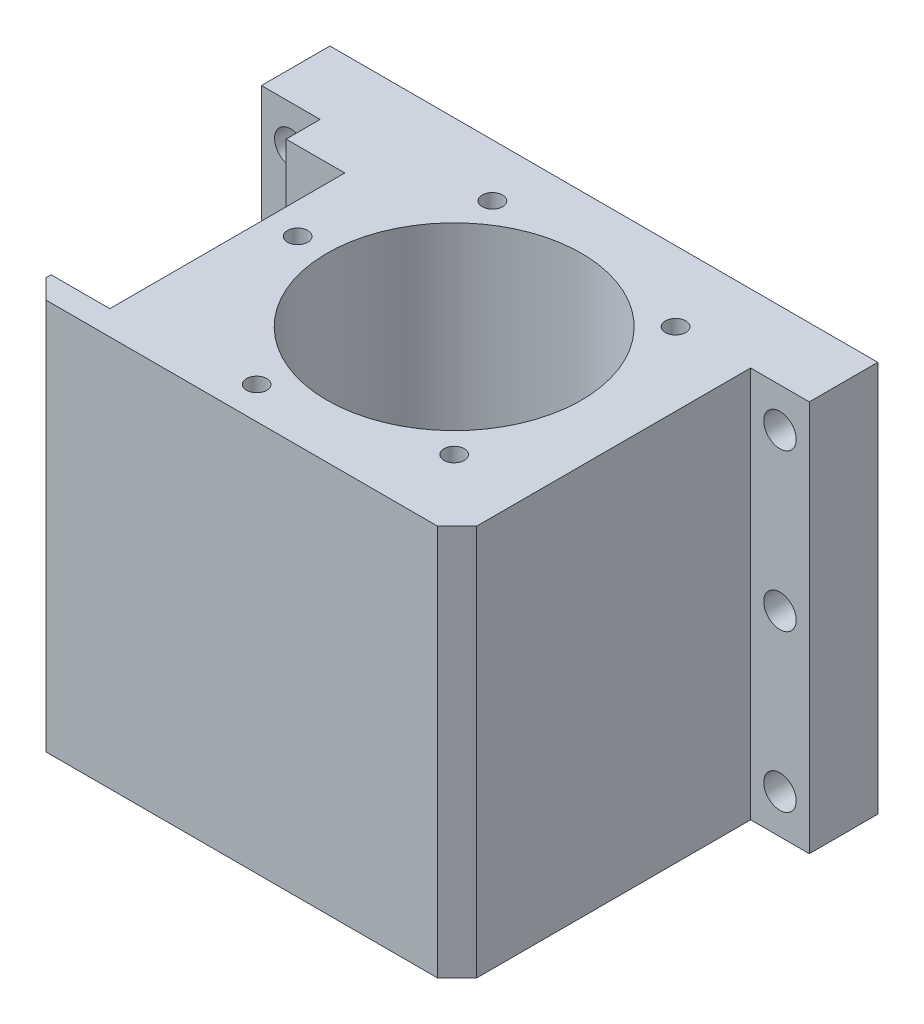
ISO-10303-21;
HEADER;
FILE_DESCRIPTION(('STEP AP214'),'2;1');
FILE_NAME('part.step','',(''),(''),'','','');
FILE_SCHEMA(('AUTOMOTIVE_DESIGN { 1 0 10303 214 1 1 1 1 }'));
ENDSEC;
DATA;
#1=APPLICATION_CONTEXT('core data for automotive mechanical design processes');
#2=APPLICATION_PROTOCOL_DEFINITION('international standard','automotive_design',2000,#1);
#3=PRODUCT_CONTEXT('',#1,'mechanical');
#4=PRODUCT('Part','Part','',(#3));
#5=PRODUCT_RELATED_PRODUCT_CATEGORY('part','',(#4));
#6=PRODUCT_DEFINITION_FORMATION('','',#4);
#7=PRODUCT_DEFINITION_CONTEXT('part definition',#1,'design');
#8=PRODUCT_DEFINITION('design','',#6,#7);
#9=PRODUCT_DEFINITION_SHAPE('','',#8);
#10=(LENGTH_UNIT() NAMED_UNIT(*) SI_UNIT(.MILLI.,.METRE.));
#11=(NAMED_UNIT(*) PLANE_ANGLE_UNIT() SI_UNIT($,.RADIAN.));
#12=(NAMED_UNIT(*) SI_UNIT($,.STERADIAN.) SOLID_ANGLE_UNIT());
#13=UNCERTAINTY_MEASURE_WITH_UNIT(LENGTH_MEASURE(1.E-05),#10,'distance_accuracy_value','');
#14=(GEOMETRIC_REPRESENTATION_CONTEXT(3) GLOBAL_UNCERTAINTY_ASSIGNED_CONTEXT((#13)) GLOBAL_UNIT_ASSIGNED_CONTEXT((#10,
#11,#12)) REPRESENTATION_CONTEXT('',''));
#15=CARTESIAN_POINT('',(0.,0.,0.));
#16=DIRECTION('',(0.,0.,1.));
#17=DIRECTION('',(1.,0.,0.));
#18=AXIS2_PLACEMENT_3D('',#15,#16,#17);
#19=CARTESIAN_POINT('',(15.,0.,17.5));
#20=DIRECTION('',(-1.,0.,0.));
#21=DIRECTION('',(0.,-1.,0.));
#22=AXIS2_PLACEMENT_3D('',#19,#20,#21);
#23=PLANE('',#22);
#24=DIRECTION('',(0.,-1.,0.));
#25=VECTOR('',#24,1.);
#26=CARTESIAN_POINT('',(15.,0.,26.2));
#27=LINE('',#26,#25);
#28=CARTESIAN_POINT('',(15.,0.,26.2));
#29=VERTEX_POINT('',#28);
#30=CARTESIAN_POINT('',(15.,-100.,26.2));
#31=VERTEX_POINT('',#30);
#32=EDGE_CURVE('E147',#29,#31,#27,.T.);
#33=ORIENTED_EDGE('',*,*,#32,.F.);
#34=DIRECTION('',(0.,0.,1.));
#35=VECTOR('',#34,1.);
#36=CARTESIAN_POINT('',(15.,0.,17.5));
#37=LINE('',#36,#35);
#38=CARTESIAN_POINT('',(15.,0.,17.5));
#39=VERTEX_POINT('',#38);
#40=EDGE_CURVE('E187',#39,#29,#37,.T.);
#41=ORIENTED_EDGE('',*,*,#40,.F.);
#42=DIRECTION('',(0.,-1.,0.));
#43=VECTOR('',#42,1.);
#44=CARTESIAN_POINT('',(15.,0.,17.5));
#45=LINE('',#44,#43);
#46=CARTESIAN_POINT('',(15.,-100.,17.5));
#47=VERTEX_POINT('',#46);
#48=EDGE_CURVE('E176',#39,#47,#45,.T.);
#49=ORIENTED_EDGE('',*,*,#48,.T.);
#50=DIRECTION('',(0.,0.,1.));
#51=VECTOR('',#50,1.);
#52=CARTESIAN_POINT('',(15.,-100.,17.5));
#53=LINE('',#52,#51);
#54=EDGE_CURVE('E196',#47,#31,#53,.T.);
#55=ORIENTED_EDGE('',*,*,#54,.T.);
#56=EDGE_LOOP('',(#33,#41,#49,#55));
#57=FACE_BOUND('',#56,.T.);
#58=ADVANCED_FACE('F38',(#57),#23,.T.);
#59=CARTESIAN_POINT('',(0.,0.,92.5));
#60=DIRECTION('',(1.,0.,0.));
#61=DIRECTION('',(0.,1.,0.));
#62=AXIS2_PLACEMENT_3D('',#59,#60,#61);
#63=PLANE('',#62);
#64=DIRECTION('',(0.,-1.,0.));
#65=VECTOR('',#64,1.);
#66=CARTESIAN_POINT('',(0.,0.,17.5));
#67=LINE('',#66,#65);
#68=CARTESIAN_POINT('',(0.,0.,17.5));
#69=VERTEX_POINT('',#68);
#70=CARTESIAN_POINT('',(0.,-100.,17.5));
#71=VERTEX_POINT('',#70);
#72=EDGE_CURVE('E199',#69,#71,#67,.T.);
#73=ORIENTED_EDGE('',*,*,#72,.F.);
#74=DIRECTION('',(0.,0.,-1.));
#75=VECTOR('',#74,1.);
#76=CARTESIAN_POINT('',(0.,0.,92.5));
#77=LINE('',#76,#75);
#78=CARTESIAN_POINT('',(0.,0.,0.));
#79=VERTEX_POINT('',#78);
#80=EDGE_CURVE('E221',#69,#79,#77,.T.);
#81=ORIENTED_EDGE('',*,*,#80,.T.);
#82=DIRECTION('',(0.,-1.,0.));
#83=VECTOR('',#82,1.);
#84=CARTESIAN_POINT('',(0.,0.,0.));
#85=LINE('',#84,#83);
#86=CARTESIAN_POINT('',(0.,-100.,0.));
#87=VERTEX_POINT('',#86);
#88=EDGE_CURVE('E210',#79,#87,#85,.T.);
#89=ORIENTED_EDGE('',*,*,#88,.T.);
#90=DIRECTION('',(0.,0.,-1.));
#91=VECTOR('',#90,1.);
#92=CARTESIAN_POINT('',(0.,-100.,92.5));
#93=LINE('',#92,#91);
#94=EDGE_CURVE('E237',#71,#87,#93,.T.);
#95=ORIENTED_EDGE('',*,*,#94,.F.);
#96=EDGE_LOOP('',(#73,#81,#89,#95));
#97=FACE_BOUND('',#96,.T.);
#98=ADVANCED_FACE('F282',(#97),#63,.F.);
#99=CARTESIAN_POINT('',(0.,-100.,92.5));
#100=DIRECTION('',(0.,1.,0.));
#101=DIRECTION('',(0.,0.,1.));
#102=AXIS2_PLACEMENT_3D('',#99,#100,#101);
#103=PLANE('',#102);
#104=CARTESIAN_POINT('',(78.,-100.,85.75));
#105=DIRECTION('',(0.,-1.,0.));
#106=DIRECTION('',(0.,0.,-1.));
#107=AXIS2_PLACEMENT_3D('',#104,#105,#106);
#108=CIRCLE('',#107,2.6);
#109=CARTESIAN_POINT('',(78.,-100.,83.15));
#110=VERTEX_POINT('',#109);
#111=EDGE_CURVE('E356',#110,#110,#108,.T.);
#112=ORIENTED_EDGE('',*,*,#111,.F.);
#113=EDGE_LOOP('',(#112));
#114=FACE_BOUND('',#113,.T.);
#115=CARTESIAN_POINT('',(43.7919965505154,-100.,65.9999999999994));
#116=DIRECTION('',(0.,-1.,0.));
#117=DIRECTION('',(0.,0.,-1.));
#118=AXIS2_PLACEMENT_3D('',#115,#116,#117);
#119=CIRCLE('',#118,2.6);
#120=CARTESIAN_POINT('',(43.7919965505154,-100.,63.3999999999994));
#121=VERTEX_POINT('',#120);
#122=EDGE_CURVE('E360',#121,#121,#119,.T.);
#123=ORIENTED_EDGE('',*,*,#122,.F.);
#124=EDGE_LOOP('',(#123));
#125=FACE_BOUND('',#124,.T.);
#126=CARTESIAN_POINT('',(43.7919965505162,-100.,26.4999999999993));
#127=DIRECTION('',(0.,-1.,0.));
#128=DIRECTION('',(0.,0.,-1.));
#129=AXIS2_PLACEMENT_3D('',#126,#127,#128);
#130=CIRCLE('',#129,2.60000000000001);
#131=CARTESIAN_POINT('',(43.7919965505162,-100.,23.8999999999993));
#132=VERTEX_POINT('',#131);
#133=EDGE_CURVE('E364',#132,#132,#130,.T.);
#134=ORIENTED_EDGE('',*,*,#133,.F.);
#135=EDGE_LOOP('',(#134));
#136=FACE_BOUND('',#135,.T.);
#137=CARTESIAN_POINT('',(78.0000000000019,-100.,6.74999999999999));
#138=DIRECTION('',(0.,-1.,0.));
#139=DIRECTION('',(0.,0.,-1.));
#140=AXIS2_PLACEMENT_3D('',#137,#138,#139);
#141=CIRCLE('',#140,2.60000000000001);
#142=CARTESIAN_POINT('',(78.0000000000019,-100.,4.14999999999998));
#143=VERTEX_POINT('',#142);
#144=EDGE_CURVE('E368',#143,#143,#141,.T.);
#145=ORIENTED_EDGE('',*,*,#144,.F.);
#146=EDGE_LOOP('',(#145));
#147=FACE_BOUND('',#146,.T.);
#148=CARTESIAN_POINT('',(112.208003449487,-100.,26.5000000000008));
#149=DIRECTION('',(0.,-1.,0.));
#150=DIRECTION('',(0.,0.,-1.));
#151=AXIS2_PLACEMENT_3D('',#148,#149,#150);
#152=CIRCLE('',#151,2.59999999999999);
#153=CARTESIAN_POINT('',(112.208003449487,-100.,23.9000000000008));
#154=VERTEX_POINT('',#153);
#155=EDGE_CURVE('E372',#154,#154,#152,.T.);
#156=ORIENTED_EDGE('',*,*,#155,.F.);
#157=EDGE_LOOP('',(#156));
#158=FACE_BOUND('',#157,.T.);
#159=CARTESIAN_POINT('',(112.208003449486,-100.,66.0000000000009));
#160=DIRECTION('',(0.,-1.,0.));
#161=DIRECTION('',(0.,0.,-1.));
#162=AXIS2_PLACEMENT_3D('',#159,#160,#161);
#163=CIRCLE('',#162,2.6);
#164=CARTESIAN_POINT('',(112.208003449486,-100.,63.4000000000009));
#165=VERTEX_POINT('',#164);
#166=EDGE_CURVE('E376',#165,#165,#163,.T.);
#167=ORIENTED_EDGE('',*,*,#166,.F.);
#168=EDGE_LOOP('',(#167));
#169=FACE_BOUND('',#168,.T.);
#170=CARTESIAN_POINT('',(78.,-100.,46.25));
#171=DIRECTION('',(0.,1.,0.));
#172=DIRECTION('',(0.,0.,1.));
#173=AXIS2_PLACEMENT_3D('',#170,#171,#172);
#174=CIRCLE('',#173,32.525);
#175=CARTESIAN_POINT('',(78.,-100.,78.775));
#176=VERTEX_POINT('',#175);
#177=EDGE_CURVE('E207',#176,#176,#174,.T.);
#178=ORIENTED_EDGE('',*,*,#177,.T.);
#179=EDGE_LOOP('',(#178));
#180=FACE_BOUND('',#179,.T.);
#181=DIRECTION('',(0.,0.,1.));
#182=VECTOR('',#181,1.);
#183=CARTESIAN_POINT('',(125.,-100.,17.5));
#184=LINE('',#183,#182);
#185=CARTESIAN_POINT('',(125.,-100.,17.5));
#186=VERTEX_POINT('',#185);
#187=CARTESIAN_POINT('',(125.,-100.,87.5));
#188=VERTEX_POINT('',#187);
#189=EDGE_CURVE('E194',#186,#188,#184,.T.);
#190=ORIENTED_EDGE('',*,*,#189,.T.);
#191=DIRECTION('',(0.707106781186548,0.,-0.707106781186548));
#192=VECTOR('',#191,1.);
#193=CARTESIAN_POINT('',(120.,-100.,92.5));
#194=LINE('',#193,#192);
#195=CARTESIAN_POINT('',(120.,-100.,92.5));
#196=VERTEX_POINT('',#195);
#197=EDGE_CURVE('E47',#188,#196,#194,.F.);
#198=ORIENTED_EDGE('',*,*,#197,.T.);
#199=DIRECTION('',(1.,0.,0.));
#200=VECTOR('',#199,1.);
#201=CARTESIAN_POINT('',(0.,-100.,92.5));
#202=LINE('',#201,#200);
#203=CARTESIAN_POINT('',(20.,-100.,92.5));
#204=VERTEX_POINT('',#203);
#205=EDGE_CURVE('E214',#204,#196,#202,.T.);
#206=ORIENTED_EDGE('',*,*,#205,.F.);
#207=DIRECTION('',(0.707106781186546,0.,0.707106781186549));
#208=VECTOR('',#207,1.);
#209=CARTESIAN_POINT('',(20.,-100.,92.5));
#210=LINE('',#209,#208);
#211=CARTESIAN_POINT('',(15.,-100.,87.5));
#212=VERTEX_POINT('',#211);
#213=EDGE_CURVE('E54',#204,#212,#210,.F.);
#214=ORIENTED_EDGE('',*,*,#213,.T.);
#215=CARTESIAN_POINT('',(15.,-100.,86.25));
#216=VERTEX_POINT('',#215);
#217=EDGE_CURVE('E186',#216,#212,#53,.T.);
#218=ORIENTED_EDGE('',*,*,#217,.F.);
#219=DIRECTION('',(-1.,0.,0.));
#220=VECTOR('',#219,1.);
#221=CARTESIAN_POINT('',(30.,-100.,86.25));
#222=LINE('',#221,#220);
#223=CARTESIAN_POINT('',(30.,-100.,86.25));
#224=VERTEX_POINT('',#223);
#225=EDGE_CURVE('E151',#224,#216,#222,.T.);
#226=ORIENTED_EDGE('',*,*,#225,.F.);
#227=DIRECTION('',(0.,0.,1.));
#228=VECTOR('',#227,1.);
#229=CARTESIAN_POINT('',(30.,-100.,26.2));
#230=LINE('',#229,#228);
#231=CARTESIAN_POINT('',(30.,-100.,26.2));
#232=VERTEX_POINT('',#231);
#233=EDGE_CURVE('E158',#232,#224,#230,.T.);
#234=ORIENTED_EDGE('',*,*,#233,.F.);
#235=DIRECTION('',(-1.,0.,0.));
#236=VECTOR('',#235,1.);
#237=CARTESIAN_POINT('',(30.,-100.,26.2));
#238=LINE('',#237,#236);
#239=EDGE_CURVE('E141',#232,#31,#238,.T.);
#240=ORIENTED_EDGE('',*,*,#239,.T.);
#241=ORIENTED_EDGE('',*,*,#54,.F.);
#242=DIRECTION('',(1.,0.,0.));
#243=VECTOR('',#242,1.);
#244=CARTESIAN_POINT('',(0.,-100.,17.5));
#245=LINE('',#244,#243);
#246=EDGE_CURVE('E202',#71,#47,#245,.T.);
#247=ORIENTED_EDGE('',*,*,#246,.F.);
#248=ORIENTED_EDGE('',*,*,#94,.T.);
#249=DIRECTION('',(1.,0.,0.));
#250=VECTOR('',#249,1.);
#251=CARTESIAN_POINT('',(0.,-100.,0.));
#252=LINE('',#251,#250);
#253=CARTESIAN_POINT('',(140.,-100.,0.));
#254=VERTEX_POINT('',#253);
#255=EDGE_CURVE('E224',#87,#254,#252,.T.);
#256=ORIENTED_EDGE('',*,*,#255,.T.);
#257=DIRECTION('',(0.,0.,-1.));
#258=VECTOR('',#257,1.);
#259=CARTESIAN_POINT('',(140.,-100.,92.5));
#260=LINE('',#259,#258);
#261=CARTESIAN_POINT('',(140.,-100.,17.5));
#262=VERTEX_POINT('',#261);
#263=EDGE_CURVE('E235',#262,#254,#260,.T.);
#264=ORIENTED_EDGE('',*,*,#263,.F.);
#265=EDGE_CURVE('E204',#186,#262,#245,.T.);
#266=ORIENTED_EDGE('',*,*,#265,.F.);
#267=EDGE_LOOP('',(#190,#198,#206,#214,#218,#226,#234,#240,#241,#247,#248,#256,#264,#266));
#268=FACE_BOUND('',#267,.T.);
#269=ADVANCED_FACE('F164',(#114,#125,#136,#147,#158,#169,#180,#268),#103,.F.);
#270=CARTESIAN_POINT('',(140.,0.,92.5));
#271=DIRECTION('',(-1.,0.,0.));
#272=DIRECTION('',(0.,0.,1.));
#273=AXIS2_PLACEMENT_3D('',#270,#271,#272);
#274=PLANE('',#273);
#275=DIRECTION('',(0.,1.,0.));
#276=VECTOR('',#275,1.);
#277=CARTESIAN_POINT('',(140.,0.,17.5));
#278=LINE('',#277,#276);
#279=CARTESIAN_POINT('',(140.,0.,17.5));
#280=VERTEX_POINT('',#279);
#281=EDGE_CURVE('E205',#262,#280,#278,.T.);
#282=ORIENTED_EDGE('',*,*,#281,.F.);
#283=ORIENTED_EDGE('',*,*,#263,.T.);
#284=DIRECTION('',(0.,1.,0.));
#285=VECTOR('',#284,1.);
#286=CARTESIAN_POINT('',(140.,0.,0.));
#287=LINE('',#286,#285);
#288=CARTESIAN_POINT('',(140.,0.,0.));
#289=VERTEX_POINT('',#288);
#290=EDGE_CURVE('E227',#254,#289,#287,.T.);
#291=ORIENTED_EDGE('',*,*,#290,.T.);
#292=DIRECTION('',(0.,0.,-1.));
#293=VECTOR('',#292,1.);
#294=CARTESIAN_POINT('',(140.,0.,92.5));
#295=LINE('',#294,#293);
#296=EDGE_CURVE('E233',#280,#289,#295,.T.);
#297=ORIENTED_EDGE('',*,*,#296,.F.);
#298=EDGE_LOOP('',(#282,#283,#291,#297));
#299=FACE_BOUND('',#298,.T.);
#300=ADVANCED_FACE('F270',(#299),#274,.F.);
#301=CARTESIAN_POINT('',(0.,0.,92.5));
#302=DIRECTION('',(0.,-1.,0.));
#303=DIRECTION('',(0.,0.,-1.));
#304=AXIS2_PLACEMENT_3D('',#301,#302,#303);
#305=PLANE('',#304);
#306=CARTESIAN_POINT('',(38.,0.,46.25));
#307=DIRECTION('',(0.,1.,0.));
#308=DIRECTION('',(0.,0.,1.));
#309=AXIS2_PLACEMENT_3D('',#306,#307,#308);
#310=CIRCLE('',#309,2.6);
#311=CARTESIAN_POINT('',(38.,0.,48.85));
#312=VERTEX_POINT('',#311);
#313=EDGE_CURVE('E468',#312,#312,#310,.T.);
#314=ORIENTED_EDGE('',*,*,#313,.F.);
#315=EDGE_LOOP('',(#314));
#316=FACE_BOUND('',#315,.T.);
#317=CARTESIAN_POINT('',(55.0258080031213,0.,13.5057409292781));
#318=DIRECTION('',(0.,1.,0.));
#319=DIRECTION('',(0.,0.,1.));
#320=AXIS2_PLACEMENT_3D('',#317,#318,#319);
#321=CIRCLE('',#320,2.6);
#322=CARTESIAN_POINT('',(55.0258080031213,0.,16.1057409292781));
#323=VERTEX_POINT('',#322);
#324=EDGE_CURVE('E462',#323,#323,#321,.T.);
#325=ORIENTED_EDGE('',*,*,#324,.F.);
#326=EDGE_LOOP('',(#325));
#327=FACE_BOUND('',#326,.T.);
#328=CARTESIAN_POINT('',(65.5344903631068,0.,84.25803953761));
#329=DIRECTION('',(0.,1.,0.));
#330=DIRECTION('',(0.,0.,1.));
#331=AXIS2_PLACEMENT_3D('',#328,#329,#330);
#332=CIRCLE('',#331,2.6);
#333=CARTESIAN_POINT('',(65.5344903631068,0.,86.85803953761));
#334=VERTEX_POINT('',#333);
#335=EDGE_CURVE('E456',#334,#334,#332,.T.);
#336=ORIENTED_EDGE('',*,*,#335,.F.);
#337=EDGE_LOOP('',(#336));
#338=FACE_BOUND('',#337,.T.);
#339=CARTESIAN_POINT('',(106.284271247462,0.,17.9657287525373));
#340=DIRECTION('',(0.,1.,0.));
#341=DIRECTION('',(0.,0.,1.));
#342=AXIS2_PLACEMENT_3D('',#339,#340,#341);
#343=CIRCLE('',#342,2.59999999999999);
#344=CARTESIAN_POINT('',(106.284271247462,0.,20.5657287525373));
#345=VERTEX_POINT('',#344);
#346=EDGE_CURVE('E450',#345,#345,#343,.T.);
#347=ORIENTED_EDGE('',*,*,#346,.F.);
#348=EDGE_LOOP('',(#347));
#349=FACE_BOUND('',#348,.T.);
#350=CARTESIAN_POINT('',(106.284271247463,0.,74.5342712474612));
#351=DIRECTION('',(0.,1.,0.));
#352=DIRECTION('',(0.,0.,1.));
#353=AXIS2_PLACEMENT_3D('',#350,#351,#352);
#354=CIRCLE('',#353,2.6);
#355=CARTESIAN_POINT('',(106.284271247463,0.,77.1342712474612));
#356=VERTEX_POINT('',#355);
#357=EDGE_CURVE('E444',#356,#356,#354,.T.);
#358=ORIENTED_EDGE('',*,*,#357,.F.);
#359=EDGE_LOOP('',(#358));
#360=FACE_BOUND('',#359,.T.);
#361=DIRECTION('',(-1.,0.,0.));
#362=VECTOR('',#361,1.);
#363=CARTESIAN_POINT('',(0.,0.,92.5));
#364=LINE('',#363,#362);
#365=CARTESIAN_POINT('',(120.,0.,92.5));
#366=VERTEX_POINT('',#365);
#367=CARTESIAN_POINT('',(20.,0.,92.5));
#368=VERTEX_POINT('',#367);
#369=EDGE_CURVE('E217',#366,#368,#364,.T.);
#370=ORIENTED_EDGE('',*,*,#369,.F.);
#371=DIRECTION('',(-0.707106781186548,0.,0.707106781186548));
#372=VECTOR('',#371,1.);
#373=CARTESIAN_POINT('',(120.,0.,92.5));
#374=LINE('',#373,#372);
#375=CARTESIAN_POINT('',(125.,0.,87.5));
#376=VERTEX_POINT('',#375);
#377=EDGE_CURVE('E247',#366,#376,#374,.F.);
#378=ORIENTED_EDGE('',*,*,#377,.T.);
#379=DIRECTION('',(0.,0.,1.));
#380=VECTOR('',#379,1.);
#381=CARTESIAN_POINT('',(125.,0.,17.5));
#382=LINE('',#381,#380);
#383=CARTESIAN_POINT('',(125.,0.,17.5));
#384=VERTEX_POINT('',#383);
#385=EDGE_CURVE('E192',#384,#376,#382,.T.);
#386=ORIENTED_EDGE('',*,*,#385,.F.);
#387=DIRECTION('',(-1.,0.,0.));
#388=VECTOR('',#387,1.);
#389=CARTESIAN_POINT('',(0.,0.,17.5));
#390=LINE('',#389,#388);
#391=EDGE_CURVE('E200',#280,#384,#390,.T.);
#392=ORIENTED_EDGE('',*,*,#391,.F.);
#393=ORIENTED_EDGE('',*,*,#296,.T.);
#394=DIRECTION('',(-1.,0.,0.));
#395=VECTOR('',#394,1.);
#396=CARTESIAN_POINT('',(0.,0.,0.));
#397=LINE('',#396,#395);
#398=EDGE_CURVE('E218',#289,#79,#397,.T.);
#399=ORIENTED_EDGE('',*,*,#398,.T.);
#400=ORIENTED_EDGE('',*,*,#80,.F.);
#401=EDGE_CURVE('E190',#39,#69,#390,.T.);
#402=ORIENTED_EDGE('',*,*,#401,.F.);
#403=ORIENTED_EDGE('',*,*,#40,.T.);
#404=DIRECTION('',(-1.,0.,0.));
#405=VECTOR('',#404,1.);
#406=CARTESIAN_POINT('',(30.,0.,26.2));
#407=LINE('',#406,#405);
#408=CARTESIAN_POINT('',(30.,0.,26.2));
#409=VERTEX_POINT('',#408);
#410=EDGE_CURVE('E174',#409,#29,#407,.T.);
#411=ORIENTED_EDGE('',*,*,#410,.F.);
#412=DIRECTION('',(0.,0.,-1.));
#413=VECTOR('',#412,1.);
#414=CARTESIAN_POINT('',(30.,0.,26.2));
#415=LINE('',#414,#413);
#416=CARTESIAN_POINT('',(30.,0.,86.25));
#417=VERTEX_POINT('',#416);
#418=EDGE_CURVE('E152',#417,#409,#415,.T.);
#419=ORIENTED_EDGE('',*,*,#418,.F.);
#420=DIRECTION('',(-1.,0.,0.));
#421=VECTOR('',#420,1.);
#422=CARTESIAN_POINT('',(30.,0.,86.25));
#423=LINE('',#422,#421);
#424=CARTESIAN_POINT('',(15.,0.,86.25));
#425=VERTEX_POINT('',#424);
#426=EDGE_CURVE('E177',#417,#425,#423,.T.);
#427=ORIENTED_EDGE('',*,*,#426,.T.);
#428=CARTESIAN_POINT('',(15.,0.,87.5));
#429=VERTEX_POINT('',#428);
#430=EDGE_CURVE('E191',#425,#429,#37,.T.);
#431=ORIENTED_EDGE('',*,*,#430,.T.);
#432=DIRECTION('',(-0.707106781186546,0.,-0.707106781186549));
#433=VECTOR('',#432,1.);
#434=CARTESIAN_POINT('',(20.,0.,92.5));
#435=LINE('',#434,#433);
#436=EDGE_CURVE('E245',#429,#368,#435,.F.);
#437=ORIENTED_EDGE('',*,*,#436,.T.);
#438=EDGE_LOOP('',(#370,#378,#386,#392,#393,#399,#400,#402,#403,#411,#419,#427,#431,#437));
#439=FACE_BOUND('',#438,.T.);
#440=CARTESIAN_POINT('',(78.,0.,46.25));
#441=DIRECTION('',(0.,1.,0.));
#442=DIRECTION('',(0.,0.,1.));
#443=AXIS2_PLACEMENT_3D('',#440,#441,#442);
#444=CIRCLE('',#443,32.525);
#445=CARTESIAN_POINT('',(78.,0.,78.775));
#446=VERTEX_POINT('',#445);
#447=EDGE_CURVE('E211',#446,#446,#444,.T.);
#448=ORIENTED_EDGE('',*,*,#447,.F.);
#449=EDGE_LOOP('',(#448));
#450=FACE_BOUND('',#449,.T.);
#451=ADVANCED_FACE('F261',(#316,#327,#338,#349,#360,#439,#450),#305,.F.);
#452=CARTESIAN_POINT('',(0.,0.,92.5));
#453=DIRECTION('',(0.,0.,1.));
#454=DIRECTION('',(1.,0.,0.));
#455=AXIS2_PLACEMENT_3D('',#452,#453,#454);
#456=PLANE('',#455);
#457=ORIENTED_EDGE('',*,*,#205,.T.);
#458=DIRECTION('',(0.,1.,0.));
#459=VECTOR('',#458,1.);
#460=CARTESIAN_POINT('',(120.,0.,92.5));
#461=LINE('',#460,#459);
#462=EDGE_CURVE('E242',#196,#366,#461,.T.);
#463=ORIENTED_EDGE('',*,*,#462,.T.);
#464=ORIENTED_EDGE('',*,*,#369,.T.);
#465=DIRECTION('',(0.,-1.,0.));
#466=VECTOR('',#465,1.);
#467=CARTESIAN_POINT('',(20.,0.,92.5));
#468=LINE('',#467,#466);
#469=EDGE_CURVE('E239',#368,#204,#468,.T.);
#470=ORIENTED_EDGE('',*,*,#469,.T.);
#471=EDGE_LOOP('',(#457,#463,#464,#470));
#472=FACE_BOUND('',#471,.T.);
#473=ADVANCED_FACE('F255',(#472),#456,.T.);
#474=CARTESIAN_POINT('',(0.,0.,0.));
#475=DIRECTION('',(0.,0.,1.));
#476=DIRECTION('',(1.,0.,0.));
#477=AXIS2_PLACEMENT_3D('',#474,#475,#476);
#478=PLANE('',#477);
#479=CARTESIAN_POINT('',(7.50000000000042,-50.,0.));
#480=DIRECTION('',(0.,0.,1.));
#481=DIRECTION('',(1.,0.,0.));
#482=AXIS2_PLACEMENT_3D('',#479,#480,#481);
#483=CIRCLE('',#482,4.15);
#484=CARTESIAN_POINT('',(11.6500000000004,-50.,0.));
#485=VERTEX_POINT('',#484);
#486=EDGE_CURVE('E429',#485,#485,#483,.T.);
#487=ORIENTED_EDGE('',*,*,#486,.T.);
#488=EDGE_LOOP('',(#487));
#489=FACE_BOUND('',#488,.T.);
#490=CARTESIAN_POINT('',(132.500000000001,-90.,0.));
#491=DIRECTION('',(0.,0.,1.));
#492=DIRECTION('',(1.,0.,0.));
#493=AXIS2_PLACEMENT_3D('',#490,#491,#492);
#494=CIRCLE('',#493,4.14999999999998);
#495=CARTESIAN_POINT('',(136.650000000001,-90.,0.));
#496=VERTEX_POINT('',#495);
#497=EDGE_CURVE('E418',#496,#496,#494,.T.);
#498=ORIENTED_EDGE('',*,*,#497,.T.);
#499=EDGE_LOOP('',(#498));
#500=FACE_BOUND('',#499,.T.);
#501=CARTESIAN_POINT('',(132.5,-50.,0.));
#502=DIRECTION('',(0.,0.,1.));
#503=DIRECTION('',(1.,0.,0.));
#504=AXIS2_PLACEMENT_3D('',#501,#502,#503);
#505=CIRCLE('',#504,4.14999999999998);
#506=CARTESIAN_POINT('',(136.65,-50.,0.));
#507=VERTEX_POINT('',#506);
#508=EDGE_CURVE('E417',#507,#507,#505,.T.);
#509=ORIENTED_EDGE('',*,*,#508,.T.);
#510=EDGE_LOOP('',(#509));
#511=FACE_BOUND('',#510,.T.);
#512=CARTESIAN_POINT('',(132.5,-10.,0.));
#513=DIRECTION('',(0.,0.,1.));
#514=DIRECTION('',(1.,0.,0.));
#515=AXIS2_PLACEMENT_3D('',#512,#513,#514);
#516=CIRCLE('',#515,4.14999999999998);
#517=CARTESIAN_POINT('',(136.65,-10.,0.));
#518=VERTEX_POINT('',#517);
#519=EDGE_CURVE('E411',#518,#518,#516,.T.);
#520=ORIENTED_EDGE('',*,*,#519,.T.);
#521=EDGE_LOOP('',(#520));
#522=FACE_BOUND('',#521,.T.);
#523=CARTESIAN_POINT('',(7.50000000000083,-90.,0.));
#524=DIRECTION('',(0.,0.,1.));
#525=DIRECTION('',(1.,0.,0.));
#526=AXIS2_PLACEMENT_3D('',#523,#524,#525);
#527=CIRCLE('',#526,4.15);
#528=CARTESIAN_POINT('',(11.6500000000008,-90.,0.));
#529=VERTEX_POINT('',#528);
#530=EDGE_CURVE('E430',#529,#529,#527,.T.);
#531=ORIENTED_EDGE('',*,*,#530,.T.);
#532=EDGE_LOOP('',(#531));
#533=FACE_BOUND('',#532,.T.);
#534=CARTESIAN_POINT('',(7.5,-10.,0.));
#535=DIRECTION('',(0.,0.,1.));
#536=DIRECTION('',(1.,0.,0.));
#537=AXIS2_PLACEMENT_3D('',#534,#535,#536);
#538=CIRCLE('',#537,4.15);
#539=CARTESIAN_POINT('',(11.65,-10.,0.));
#540=VERTEX_POINT('',#539);
#541=EDGE_CURVE('E403',#540,#540,#538,.T.);
#542=ORIENTED_EDGE('',*,*,#541,.T.);
#543=EDGE_LOOP('',(#542));
#544=FACE_BOUND('',#543,.T.);
#545=ORIENTED_EDGE('',*,*,#88,.F.);
#546=ORIENTED_EDGE('',*,*,#398,.F.);
#547=ORIENTED_EDGE('',*,*,#290,.F.);
#548=ORIENTED_EDGE('',*,*,#255,.F.);
#549=EDGE_LOOP('',(#545,#546,#547,#548));
#550=FACE_BOUND('',#549,.T.);
#551=ADVANCED_FACE('F277',(#489,#500,#511,#522,#533,#544,#550),#478,.F.);
#552=CARTESIAN_POINT('',(78.,-100.,46.25));
#553=DIRECTION('',(0.,1.,0.));
#554=DIRECTION('',(0.,0.,1.));
#555=AXIS2_PLACEMENT_3D('',#552,#553,#554);
#556=CYLINDRICAL_SURFACE('',#555,32.525);
#557=ORIENTED_EDGE('',*,*,#177,.F.);
#558=EDGE_LOOP('',(#557));
#559=FACE_BOUND('',#558,.T.);
#560=ORIENTED_EDGE('',*,*,#447,.T.);
#561=EDGE_LOOP('',(#560));
#562=FACE_BOUND('',#561,.T.);
#563=ADVANCED_FACE('F330',(#559,#562),#556,.F.);
#564=CARTESIAN_POINT('',(125.,0.,17.5));
#565=DIRECTION('',(1.,0.,0.));
#566=DIRECTION('',(0.,1.,0.));
#567=AXIS2_PLACEMENT_3D('',#564,#565,#566);
#568=PLANE('',#567);
#569=ORIENTED_EDGE('',*,*,#385,.T.);
#570=DIRECTION('',(0.,-1.,0.));
#571=VECTOR('',#570,1.);
#572=CARTESIAN_POINT('',(125.,0.,87.5));
#573=LINE('',#572,#571);
#574=EDGE_CURVE('E62',#376,#188,#573,.T.);
#575=ORIENTED_EDGE('',*,*,#574,.T.);
#576=ORIENTED_EDGE('',*,*,#189,.F.);
#577=DIRECTION('',(0.,1.,0.));
#578=VECTOR('',#577,1.);
#579=CARTESIAN_POINT('',(125.,0.,17.5));
#580=LINE('',#579,#578);
#581=EDGE_CURVE('E183',#186,#384,#580,.T.);
#582=ORIENTED_EDGE('',*,*,#581,.T.);
#583=EDGE_LOOP('',(#569,#575,#576,#582));
#584=FACE_BOUND('',#583,.T.);
#585=ADVANCED_FACE('F264',(#584),#568,.T.);
#586=CARTESIAN_POINT('',(70.,-50.,17.5));
#587=DIRECTION('',(0.,0.,1.));
#588=DIRECTION('',(1.,0.,0.));
#589=AXIS2_PLACEMENT_3D('',#586,#587,#588);
#590=PLANE('',#589);
#591=CARTESIAN_POINT('',(132.500000000001,-90.,17.5));
#592=DIRECTION('',(0.,0.,1.));
#593=DIRECTION('',(1.,0.,0.));
#594=AXIS2_PLACEMENT_3D('',#591,#592,#593);
#595=CIRCLE('',#594,4.14999999999998);
#596=CARTESIAN_POINT('',(136.650000000001,-90.,17.5));
#597=VERTEX_POINT('',#596);
#598=EDGE_CURVE('E433',#597,#597,#595,.T.);
#599=ORIENTED_EDGE('',*,*,#598,.F.);
#600=EDGE_LOOP('',(#599));
#601=FACE_BOUND('',#600,.T.);
#602=CARTESIAN_POINT('',(132.5,-50.,17.5));
#603=DIRECTION('',(0.,0.,1.));
#604=DIRECTION('',(1.,0.,0.));
#605=AXIS2_PLACEMENT_3D('',#602,#603,#604);
#606=CIRCLE('',#605,4.14999999999998);
#607=CARTESIAN_POINT('',(136.65,-50.,17.5));
#608=VERTEX_POINT('',#607);
#609=EDGE_CURVE('E414',#608,#608,#606,.T.);
#610=ORIENTED_EDGE('',*,*,#609,.F.);
#611=EDGE_LOOP('',(#610));
#612=FACE_BOUND('',#611,.T.);
#613=CARTESIAN_POINT('',(132.5,-10.,17.5));
#614=DIRECTION('',(0.,0.,1.));
#615=DIRECTION('',(1.,0.,0.));
#616=AXIS2_PLACEMENT_3D('',#613,#614,#615);
#617=CIRCLE('',#616,4.14999999999998);
#618=CARTESIAN_POINT('',(136.65,-10.,17.5));
#619=VERTEX_POINT('',#618);
#620=EDGE_CURVE('E421',#619,#619,#617,.T.);
#621=ORIENTED_EDGE('',*,*,#620,.F.);
#622=EDGE_LOOP('',(#621));
#623=FACE_BOUND('',#622,.T.);
#624=ORIENTED_EDGE('',*,*,#265,.T.);
#625=ORIENTED_EDGE('',*,*,#281,.T.);
#626=ORIENTED_EDGE('',*,*,#391,.T.);
#627=ORIENTED_EDGE('',*,*,#581,.F.);
#628=EDGE_LOOP('',(#624,#625,#626,#627));
#629=FACE_BOUND('',#628,.T.);
#630=ADVANCED_FACE('F266',(#601,#612,#623,#629),#590,.T.);
#631=CARTESIAN_POINT('',(7.50000000000042,-50.,17.5));
#632=DIRECTION('',(0.,0.,1.));
#633=DIRECTION('',(1.,0.,0.));
#634=AXIS2_PLACEMENT_3D('',#631,#632,#633);
#635=CIRCLE('',#634,4.15);
#636=CARTESIAN_POINT('',(11.6500000000004,-50.,17.5));
#637=VERTEX_POINT('',#636);
#638=EDGE_CURVE('E426',#637,#637,#635,.T.);
#639=ORIENTED_EDGE('',*,*,#638,.F.);
#640=EDGE_LOOP('',(#639));
#641=FACE_BOUND('',#640,.T.);
#642=CARTESIAN_POINT('',(7.50000000000083,-90.,17.5));
#643=DIRECTION('',(0.,0.,1.));
#644=DIRECTION('',(1.,0.,0.));
#645=AXIS2_PLACEMENT_3D('',#642,#643,#644);
#646=CIRCLE('',#645,4.15);
#647=CARTESIAN_POINT('',(11.6500000000008,-90.,17.5));
#648=VERTEX_POINT('',#647);
#649=EDGE_CURVE('E438',#648,#648,#646,.T.);
#650=ORIENTED_EDGE('',*,*,#649,.F.);
#651=EDGE_LOOP('',(#650));
#652=FACE_BOUND('',#651,.T.);
#653=CARTESIAN_POINT('',(7.5,-10.,17.5));
#654=DIRECTION('',(0.,0.,1.));
#655=DIRECTION('',(1.,0.,0.));
#656=AXIS2_PLACEMENT_3D('',#653,#654,#655);
#657=CIRCLE('',#656,4.15);
#658=CARTESIAN_POINT('',(11.65,-10.,17.5));
#659=VERTEX_POINT('',#658);
#660=EDGE_CURVE('E408',#659,#659,#657,.T.);
#661=ORIENTED_EDGE('',*,*,#660,.F.);
#662=EDGE_LOOP('',(#661));
#663=FACE_BOUND('',#662,.T.);
#664=ORIENTED_EDGE('',*,*,#246,.T.);
#665=ORIENTED_EDGE('',*,*,#48,.F.);
#666=ORIENTED_EDGE('',*,*,#401,.T.);
#667=ORIENTED_EDGE('',*,*,#72,.T.);
#668=EDGE_LOOP('',(#664,#665,#666,#667));
#669=FACE_BOUND('',#668,.T.);
#670=ADVANCED_FACE('F286',(#641,#652,#663,#669),#590,.T.);
#671=ORIENTED_EDGE('',*,*,#217,.T.);
#672=DIRECTION('',(0.,1.,0.));
#673=VECTOR('',#672,1.);
#674=CARTESIAN_POINT('',(15.,0.,87.5));
#675=LINE('',#674,#673);
#676=EDGE_CURVE('E12',#212,#429,#675,.T.);
#677=ORIENTED_EDGE('',*,*,#676,.T.);
#678=ORIENTED_EDGE('',*,*,#430,.F.);
#679=DIRECTION('',(0.,1.,0.));
#680=VECTOR('',#679,1.);
#681=CARTESIAN_POINT('',(15.,0.,86.25));
#682=LINE('',#681,#680);
#683=EDGE_CURVE('E162',#216,#425,#682,.T.);
#684=ORIENTED_EDGE('',*,*,#683,.F.);
#685=EDGE_LOOP('',(#671,#677,#678,#684));
#686=FACE_BOUND('',#685,.T.);
#687=ADVANCED_FACE('F295',(#686),#23,.T.);
#688=CARTESIAN_POINT('',(30.,0.,26.2));
#689=DIRECTION('',(0.,0.,-1.));
#690=DIRECTION('',(0.,1.,0.));
#691=AXIS2_PLACEMENT_3D('',#688,#689,#690);
#692=PLANE('',#691);
#693=ORIENTED_EDGE('',*,*,#32,.T.);
#694=ORIENTED_EDGE('',*,*,#239,.F.);
#695=DIRECTION('',(0.,-1.,0.));
#696=VECTOR('',#695,1.);
#697=CARTESIAN_POINT('',(30.,0.,26.2));
#698=LINE('',#697,#696);
#699=EDGE_CURVE('E144',#409,#232,#698,.T.);
#700=ORIENTED_EDGE('',*,*,#699,.F.);
#701=ORIENTED_EDGE('',*,*,#410,.T.);
#702=EDGE_LOOP('',(#693,#694,#700,#701));
#703=FACE_BOUND('',#702,.T.);
#704=ADVANCED_FACE('F143',(#703),#692,.F.);
#705=CARTESIAN_POINT('',(30.,0.,86.25));
#706=DIRECTION('',(0.,0.,1.));
#707=DIRECTION('',(0.,-1.,0.));
#708=AXIS2_PLACEMENT_3D('',#705,#706,#707);
#709=PLANE('',#708);
#710=ORIENTED_EDGE('',*,*,#683,.T.);
#711=ORIENTED_EDGE('',*,*,#426,.F.);
#712=DIRECTION('',(0.,1.,0.));
#713=VECTOR('',#712,1.);
#714=CARTESIAN_POINT('',(30.,0.,86.25));
#715=LINE('',#714,#713);
#716=EDGE_CURVE('E165',#224,#417,#715,.T.);
#717=ORIENTED_EDGE('',*,*,#716,.F.);
#718=ORIENTED_EDGE('',*,*,#225,.T.);
#719=EDGE_LOOP('',(#710,#711,#717,#718));
#720=FACE_BOUND('',#719,.T.);
#721=ADVANCED_FACE('F320',(#720),#709,.F.);
#722=CARTESIAN_POINT('',(30.,0.,0.));
#723=DIRECTION('',(-1.,0.,0.));
#724=DIRECTION('',(0.,-1.,0.));
#725=AXIS2_PLACEMENT_3D('',#722,#723,#724);
#726=PLANE('',#725);
#727=ORIENTED_EDGE('',*,*,#699,.T.);
#728=ORIENTED_EDGE('',*,*,#233,.T.);
#729=ORIENTED_EDGE('',*,*,#716,.T.);
#730=ORIENTED_EDGE('',*,*,#418,.T.);
#731=EDGE_LOOP('',(#727,#728,#729,#730));
#732=FACE_BOUND('',#731,.T.);
#733=ADVANCED_FACE('F156',(#732),#726,.T.);
#734=CARTESIAN_POINT('',(120.,0.,92.5));
#735=DIRECTION('',(-0.707106781186547,0.,-0.707106781186547));
#736=DIRECTION('',(0.,1.,0.));
#737=AXIS2_PLACEMENT_3D('',#734,#735,#736);
#738=PLANE('',#737);
#739=ORIENTED_EDGE('',*,*,#197,.F.);
#740=ORIENTED_EDGE('',*,*,#574,.F.);
#741=ORIENTED_EDGE('',*,*,#377,.F.);
#742=ORIENTED_EDGE('',*,*,#462,.F.);
#743=EDGE_LOOP('',(#739,#740,#741,#742));
#744=FACE_BOUND('',#743,.T.);
#745=ADVANCED_FACE('F258',(#744),#738,.F.);
#746=CARTESIAN_POINT('',(20.,0.,92.5));
#747=DIRECTION('',(0.707106781186549,0.,-0.707106781186545));
#748=DIRECTION('',(0.,-1.,0.));
#749=AXIS2_PLACEMENT_3D('',#746,#747,#748);
#750=PLANE('',#749);
#751=ORIENTED_EDGE('',*,*,#436,.F.);
#752=ORIENTED_EDGE('',*,*,#676,.F.);
#753=ORIENTED_EDGE('',*,*,#213,.F.);
#754=ORIENTED_EDGE('',*,*,#469,.F.);
#755=EDGE_LOOP('',(#751,#752,#753,#754));
#756=FACE_BOUND('',#755,.T.);
#757=ADVANCED_FACE('F41',(#756),#750,.F.);
#758=CARTESIAN_POINT('',(112.208003449486,-80.,66.0000000000009));
#759=DIRECTION('',(0.,-1.,0.));
#760=DIRECTION('',(0.,0.,-1.));
#761=AXIS2_PLACEMENT_3D('',#758,#759,#760);
#762=CYLINDRICAL_SURFACE('',#761,2.6);
#763=CARTESIAN_POINT('',(112.208003449486,-80.,66.0000000000009));
#764=DIRECTION('',(0.,-1.,0.));
#765=DIRECTION('',(0.,0.,-1.));
#766=AXIS2_PLACEMENT_3D('',#763,#764,#765);
#767=CIRCLE('',#766,2.6);
#768=CARTESIAN_POINT('',(112.208003449486,-80.,63.4000000000009));
#769=VERTEX_POINT('',#768);
#770=EDGE_CURVE('E381',#769,#769,#767,.T.);
#771=ORIENTED_EDGE('',*,*,#770,.F.);
#772=EDGE_LOOP('',(#771));
#773=FACE_BOUND('',#772,.T.);
#774=ORIENTED_EDGE('',*,*,#166,.T.);
#775=EDGE_LOOP('',(#774));
#776=FACE_BOUND('',#775,.T.);
#777=ADVANCED_FACE('F299',(#773,#776),#762,.F.);
#778=CARTESIAN_POINT('',(112.208003449486,-80.,66.0000000000009));
#779=DIRECTION('',(0.,-1.,0.));
#780=DIRECTION('',(0.,0.,-1.));
#781=AXIS2_PLACEMENT_3D('',#778,#779,#780);
#782=PLANE('',#781);
#783=ORIENTED_EDGE('',*,*,#770,.T.);
#784=EDGE_LOOP('',(#783));
#785=FACE_BOUND('',#784,.T.);
#786=ADVANCED_FACE('F304',(#785),#782,.T.);
#787=CARTESIAN_POINT('',(112.208003449487,-80.,26.5000000000008));
#788=DIRECTION('',(0.,-1.,0.));
#789=DIRECTION('',(0.,0.,-1.));
#790=AXIS2_PLACEMENT_3D('',#787,#788,#789);
#791=CYLINDRICAL_SURFACE('',#790,2.59999999999999);
#792=CARTESIAN_POINT('',(112.208003449487,-80.,26.5000000000008));
#793=DIRECTION('',(0.,-1.,0.));
#794=DIRECTION('',(0.,0.,-1.));
#795=AXIS2_PLACEMENT_3D('',#792,#793,#794);
#796=CIRCLE('',#795,2.59999999999999);
#797=CARTESIAN_POINT('',(112.208003449487,-80.,23.9000000000008));
#798=VERTEX_POINT('',#797);
#799=EDGE_CURVE('E382',#798,#798,#796,.T.);
#800=ORIENTED_EDGE('',*,*,#799,.F.);
#801=EDGE_LOOP('',(#800));
#802=FACE_BOUND('',#801,.T.);
#803=ORIENTED_EDGE('',*,*,#155,.T.);
#804=EDGE_LOOP('',(#803));
#805=FACE_BOUND('',#804,.T.);
#806=ADVANCED_FACE('F546',(#802,#805),#791,.F.);
#807=CARTESIAN_POINT('',(112.208003449487,-80.,26.5000000000008));
#808=DIRECTION('',(0.,-1.,0.));
#809=DIRECTION('',(0.,0.,-1.));
#810=AXIS2_PLACEMENT_3D('',#807,#808,#809);
#811=PLANE('',#810);
#812=ORIENTED_EDGE('',*,*,#799,.T.);
#813=EDGE_LOOP('',(#812));
#814=FACE_BOUND('',#813,.T.);
#815=ADVANCED_FACE('F549',(#814),#811,.T.);
#816=CARTESIAN_POINT('',(78.0000000000019,-80.,6.74999999999999));
#817=DIRECTION('',(0.,-1.,0.));
#818=DIRECTION('',(0.,0.,-1.));
#819=AXIS2_PLACEMENT_3D('',#816,#817,#818);
#820=CYLINDRICAL_SURFACE('',#819,2.60000000000001);
#821=CARTESIAN_POINT('',(78.0000000000019,-80.,6.74999999999999));
#822=DIRECTION('',(0.,-1.,0.));
#823=DIRECTION('',(0.,0.,-1.));
#824=AXIS2_PLACEMENT_3D('',#821,#822,#823);
#825=CIRCLE('',#824,2.60000000000001);
#826=CARTESIAN_POINT('',(78.0000000000019,-80.,4.14999999999998));
#827=VERTEX_POINT('',#826);
#828=EDGE_CURVE('E391',#827,#827,#825,.T.);
#829=ORIENTED_EDGE('',*,*,#828,.F.);
#830=EDGE_LOOP('',(#829));
#831=FACE_BOUND('',#830,.T.);
#832=ORIENTED_EDGE('',*,*,#144,.T.);
#833=EDGE_LOOP('',(#832));
#834=FACE_BOUND('',#833,.T.);
#835=ADVANCED_FACE('F552',(#831,#834),#820,.F.);
#836=CARTESIAN_POINT('',(78.0000000000019,-80.,6.74999999999999));
#837=DIRECTION('',(0.,-1.,0.));
#838=DIRECTION('',(0.,0.,-1.));
#839=AXIS2_PLACEMENT_3D('',#836,#837,#838);
#840=PLANE('',#839);
#841=ORIENTED_EDGE('',*,*,#828,.T.);
#842=EDGE_LOOP('',(#841));
#843=FACE_BOUND('',#842,.T.);
#844=ADVANCED_FACE('F557',(#843),#840,.T.);
#845=CARTESIAN_POINT('',(43.7919965505162,-80.,26.4999999999993));
#846=DIRECTION('',(0.,-1.,0.));
#847=DIRECTION('',(0.,0.,-1.));
#848=AXIS2_PLACEMENT_3D('',#845,#846,#847);
#849=CYLINDRICAL_SURFACE('',#848,2.60000000000001);
#850=CARTESIAN_POINT('',(43.7919965505162,-80.,26.4999999999993));
#851=DIRECTION('',(0.,-1.,0.));
#852=DIRECTION('',(0.,0.,-1.));
#853=AXIS2_PLACEMENT_3D('',#850,#851,#852);
#854=CIRCLE('',#853,2.60000000000001);
#855=CARTESIAN_POINT('',(43.7919965505162,-80.,23.8999999999993));
#856=VERTEX_POINT('',#855);
#857=EDGE_CURVE('E395',#856,#856,#854,.T.);
#858=ORIENTED_EDGE('',*,*,#857,.F.);
#859=EDGE_LOOP('',(#858));
#860=FACE_BOUND('',#859,.T.);
#861=ORIENTED_EDGE('',*,*,#133,.T.);
#862=EDGE_LOOP('',(#861));
#863=FACE_BOUND('',#862,.T.);
#864=ADVANCED_FACE('F560',(#860,#863),#849,.F.);
#865=CARTESIAN_POINT('',(43.7919965505162,-80.,26.4999999999993));
#866=DIRECTION('',(0.,-1.,0.));
#867=DIRECTION('',(0.,0.,-1.));
#868=AXIS2_PLACEMENT_3D('',#865,#866,#867);
#869=PLANE('',#868);
#870=ORIENTED_EDGE('',*,*,#857,.T.);
#871=EDGE_LOOP('',(#870));
#872=FACE_BOUND('',#871,.T.);
#873=ADVANCED_FACE('F543',(#872),#869,.T.);
#874=CARTESIAN_POINT('',(43.7919965505154,-80.,65.9999999999994));
#875=DIRECTION('',(0.,-1.,0.));
#876=DIRECTION('',(0.,0.,-1.));
#877=AXIS2_PLACEMENT_3D('',#874,#875,#876);
#878=CYLINDRICAL_SURFACE('',#877,2.6);
#879=CARTESIAN_POINT('',(43.7919965505154,-80.,65.9999999999994));
#880=DIRECTION('',(0.,-1.,0.));
#881=DIRECTION('',(0.,0.,-1.));
#882=AXIS2_PLACEMENT_3D('',#879,#880,#881);
#883=CIRCLE('',#882,2.6);
#884=CARTESIAN_POINT('',(43.7919965505154,-80.,63.3999999999994));
#885=VERTEX_POINT('',#884);
#886=EDGE_CURVE('E397',#885,#885,#883,.T.);
#887=ORIENTED_EDGE('',*,*,#886,.F.);
#888=EDGE_LOOP('',(#887));
#889=FACE_BOUND('',#888,.T.);
#890=ORIENTED_EDGE('',*,*,#122,.T.);
#891=EDGE_LOOP('',(#890));
#892=FACE_BOUND('',#891,.T.);
#893=ADVANCED_FACE('F540',(#889,#892),#878,.F.);
#894=CARTESIAN_POINT('',(43.7919965505154,-80.,65.9999999999994));
#895=DIRECTION('',(0.,-1.,0.));
#896=DIRECTION('',(0.,0.,-1.));
#897=AXIS2_PLACEMENT_3D('',#894,#895,#896);
#898=PLANE('',#897);
#899=ORIENTED_EDGE('',*,*,#886,.T.);
#900=EDGE_LOOP('',(#899));
#901=FACE_BOUND('',#900,.T.);
#902=ADVANCED_FACE('F536',(#901),#898,.T.);
#903=CARTESIAN_POINT('',(78.,-80.,85.75));
#904=DIRECTION('',(0.,-1.,0.));
#905=DIRECTION('',(0.,0.,-1.));
#906=AXIS2_PLACEMENT_3D('',#903,#904,#905);
#907=CYLINDRICAL_SURFACE('',#906,2.6);
#908=CARTESIAN_POINT('',(78.,-80.,85.75));
#909=DIRECTION('',(0.,-1.,0.));
#910=DIRECTION('',(0.,0.,-1.));
#911=AXIS2_PLACEMENT_3D('',#908,#909,#910);
#912=CIRCLE('',#911,2.6);
#913=CARTESIAN_POINT('',(78.,-80.,83.15));
#914=VERTEX_POINT('',#913);
#915=EDGE_CURVE('E172',#914,#914,#912,.T.);
#916=ORIENTED_EDGE('',*,*,#915,.F.);
#917=EDGE_LOOP('',(#916));
#918=FACE_BOUND('',#917,.T.);
#919=ORIENTED_EDGE('',*,*,#111,.T.);
#920=EDGE_LOOP('',(#919));
#921=FACE_BOUND('',#920,.T.);
#922=ADVANCED_FACE('F532',(#918,#921),#907,.F.);
#923=CARTESIAN_POINT('',(78.,-80.,85.75));
#924=DIRECTION('',(0.,-1.,0.));
#925=DIRECTION('',(0.,0.,-1.));
#926=AXIS2_PLACEMENT_3D('',#923,#924,#925);
#927=PLANE('',#926);
#928=ORIENTED_EDGE('',*,*,#915,.T.);
#929=EDGE_LOOP('',(#928));
#930=FACE_BOUND('',#929,.T.);
#931=ADVANCED_FACE('F528',(#930),#927,.T.);
#932=CARTESIAN_POINT('',(7.5,-10.,0.));
#933=DIRECTION('',(0.,0.,1.));
#934=DIRECTION('',(1.,0.,0.));
#935=AXIS2_PLACEMENT_3D('',#932,#933,#934);
#936=CYLINDRICAL_SURFACE('',#935,4.15);
#937=ORIENTED_EDGE('',*,*,#541,.F.);
#938=EDGE_LOOP('',(#937));
#939=FACE_BOUND('',#938,.T.);
#940=ORIENTED_EDGE('',*,*,#660,.T.);
#941=EDGE_LOOP('',(#940));
#942=FACE_BOUND('',#941,.T.);
#943=ADVANCED_FACE('F513',(#939,#942),#936,.F.);
#944=CARTESIAN_POINT('',(7.50000000000083,-90.,0.));
#945=DIRECTION('',(0.,0.,1.));
#946=DIRECTION('',(1.,0.,0.));
#947=AXIS2_PLACEMENT_3D('',#944,#945,#946);
#948=CYLINDRICAL_SURFACE('',#947,4.15);
#949=ORIENTED_EDGE('',*,*,#530,.F.);
#950=EDGE_LOOP('',(#949));
#951=FACE_BOUND('',#950,.T.);
#952=ORIENTED_EDGE('',*,*,#649,.T.);
#953=EDGE_LOOP('',(#952));
#954=FACE_BOUND('',#953,.T.);
#955=ADVANCED_FACE('F510',(#951,#954),#948,.F.);
#956=CARTESIAN_POINT('',(7.50000000000042,-50.,0.));
#957=DIRECTION('',(0.,0.,1.));
#958=DIRECTION('',(1.,0.,0.));
#959=AXIS2_PLACEMENT_3D('',#956,#957,#958);
#960=CYLINDRICAL_SURFACE('',#959,4.15);
#961=ORIENTED_EDGE('',*,*,#486,.F.);
#962=EDGE_LOOP('',(#961));
#963=FACE_BOUND('',#962,.T.);
#964=ORIENTED_EDGE('',*,*,#638,.T.);
#965=EDGE_LOOP('',(#964));
#966=FACE_BOUND('',#965,.T.);
#967=ADVANCED_FACE('F512',(#963,#966),#960,.F.);
#968=CARTESIAN_POINT('',(132.5,-10.,0.));
#969=DIRECTION('',(0.,0.,1.));
#970=DIRECTION('',(1.,0.,0.));
#971=AXIS2_PLACEMENT_3D('',#968,#969,#970);
#972=CYLINDRICAL_SURFACE('',#971,4.14999999999998);
#973=ORIENTED_EDGE('',*,*,#519,.F.);
#974=EDGE_LOOP('',(#973));
#975=FACE_BOUND('',#974,.T.);
#976=ORIENTED_EDGE('',*,*,#620,.T.);
#977=EDGE_LOOP('',(#976));
#978=FACE_BOUND('',#977,.T.);
#979=ADVANCED_FACE('F518',(#975,#978),#972,.F.);
#980=CARTESIAN_POINT('',(132.5,-50.,0.));
#981=DIRECTION('',(0.,0.,1.));
#982=DIRECTION('',(1.,0.,0.));
#983=AXIS2_PLACEMENT_3D('',#980,#981,#982);
#984=CYLINDRICAL_SURFACE('',#983,4.14999999999998);
#985=ORIENTED_EDGE('',*,*,#508,.F.);
#986=EDGE_LOOP('',(#985));
#987=FACE_BOUND('',#986,.T.);
#988=ORIENTED_EDGE('',*,*,#609,.T.);
#989=EDGE_LOOP('',(#988));
#990=FACE_BOUND('',#989,.T.);
#991=ADVANCED_FACE('F504',(#987,#990),#984,.F.);
#992=CARTESIAN_POINT('',(132.500000000001,-90.,0.));
#993=DIRECTION('',(0.,0.,1.));
#994=DIRECTION('',(1.,0.,0.));
#995=AXIS2_PLACEMENT_3D('',#992,#993,#994);
#996=CYLINDRICAL_SURFACE('',#995,4.14999999999998);
#997=ORIENTED_EDGE('',*,*,#497,.F.);
#998=EDGE_LOOP('',(#997));
#999=FACE_BOUND('',#998,.T.);
#1000=ORIENTED_EDGE('',*,*,#598,.T.);
#1001=EDGE_LOOP('',(#1000));
#1002=FACE_BOUND('',#1001,.T.);
#1003=ADVANCED_FACE('F494',(#999,#1002),#996,.F.);
#1004=CARTESIAN_POINT('',(106.284271247463,-20.,74.5342712474612));
#1005=DIRECTION('',(0.,1.,0.));
#1006=DIRECTION('',(0.,0.,1.));
#1007=AXIS2_PLACEMENT_3D('',#1004,#1005,#1006);
#1008=CYLINDRICAL_SURFACE('',#1007,2.6);
#1009=CARTESIAN_POINT('',(106.284271247463,-20.,74.5342712474612));
#1010=DIRECTION('',(0.,1.,0.));
#1011=DIRECTION('',(0.,0.,1.));
#1012=AXIS2_PLACEMENT_3D('',#1009,#1010,#1011);
#1013=CIRCLE('',#1012,2.6);
#1014=CARTESIAN_POINT('',(106.284271247463,-20.,77.1342712474612));
#1015=VERTEX_POINT('',#1014);
#1016=EDGE_CURVE('E447',#1015,#1015,#1013,.T.);
#1017=ORIENTED_EDGE('',*,*,#1016,.F.);
#1018=EDGE_LOOP('',(#1017));
#1019=FACE_BOUND('',#1018,.T.);
#1020=ORIENTED_EDGE('',*,*,#357,.T.);
#1021=EDGE_LOOP('',(#1020));
#1022=FACE_BOUND('',#1021,.T.);
#1023=ADVANCED_FACE('F491',(#1019,#1022),#1008,.F.);
#1024=CARTESIAN_POINT('',(106.284271247463,-20.,74.5342712474612));
#1025=DIRECTION('',(0.,1.,0.));
#1026=DIRECTION('',(0.,0.,1.));
#1027=AXIS2_PLACEMENT_3D('',#1024,#1025,#1026);
#1028=PLANE('',#1027);
#1029=ORIENTED_EDGE('',*,*,#1016,.T.);
#1030=EDGE_LOOP('',(#1029));
#1031=FACE_BOUND('',#1030,.T.);
#1032=ADVANCED_FACE('F493',(#1031),#1028,.T.);
#1033=CARTESIAN_POINT('',(106.284271247462,-20.,17.9657287525373));
#1034=DIRECTION('',(0.,1.,0.));
#1035=DIRECTION('',(0.,0.,1.));
#1036=AXIS2_PLACEMENT_3D('',#1033,#1034,#1035);
#1037=CYLINDRICAL_SURFACE('',#1036,2.59999999999999);
#1038=CARTESIAN_POINT('',(106.284271247462,-20.,17.9657287525373));
#1039=DIRECTION('',(0.,1.,0.));
#1040=DIRECTION('',(0.,0.,1.));
#1041=AXIS2_PLACEMENT_3D('',#1038,#1039,#1040);
#1042=CIRCLE('',#1041,2.59999999999999);
#1043=CARTESIAN_POINT('',(106.284271247462,-20.,20.5657287525373));
#1044=VERTEX_POINT('',#1043);
#1045=EDGE_CURVE('E453',#1044,#1044,#1042,.T.);
#1046=ORIENTED_EDGE('',*,*,#1045,.F.);
#1047=EDGE_LOOP('',(#1046));
#1048=FACE_BOUND('',#1047,.T.);
#1049=ORIENTED_EDGE('',*,*,#346,.T.);
#1050=EDGE_LOOP('',(#1049));
#1051=FACE_BOUND('',#1050,.T.);
#1052=ADVANCED_FACE('F501',(#1048,#1051),#1037,.F.);
#1053=CARTESIAN_POINT('',(106.284271247462,-20.,17.9657287525373));
#1054=DIRECTION('',(0.,1.,0.));
#1055=DIRECTION('',(0.,0.,1.));
#1056=AXIS2_PLACEMENT_3D('',#1053,#1054,#1055);
#1057=PLANE('',#1056);
#1058=ORIENTED_EDGE('',*,*,#1045,.T.);
#1059=EDGE_LOOP('',(#1058));
#1060=FACE_BOUND('',#1059,.T.);
#1061=ADVANCED_FACE('F657',(#1060),#1057,.T.);
#1062=CARTESIAN_POINT('',(65.5344903631068,-20.,84.25803953761));
#1063=DIRECTION('',(0.,1.,0.));
#1064=DIRECTION('',(0.,0.,1.));
#1065=AXIS2_PLACEMENT_3D('',#1062,#1063,#1064);
#1066=CYLINDRICAL_SURFACE('',#1065,2.6);
#1067=CARTESIAN_POINT('',(65.5344903631068,-20.,84.25803953761));
#1068=DIRECTION('',(0.,1.,0.));
#1069=DIRECTION('',(0.,0.,1.));
#1070=AXIS2_PLACEMENT_3D('',#1067,#1068,#1069);
#1071=CIRCLE('',#1070,2.6);
#1072=CARTESIAN_POINT('',(65.5344903631068,-20.,86.85803953761));
#1073=VERTEX_POINT('',#1072);
#1074=EDGE_CURVE('E459',#1073,#1073,#1071,.T.);
#1075=ORIENTED_EDGE('',*,*,#1074,.F.);
#1076=EDGE_LOOP('',(#1075));
#1077=FACE_BOUND('',#1076,.T.);
#1078=ORIENTED_EDGE('',*,*,#335,.T.);
#1079=EDGE_LOOP('',(#1078));
#1080=FACE_BOUND('',#1079,.T.);
#1081=ADVANCED_FACE('F666',(#1077,#1080),#1066,.F.);
#1082=CARTESIAN_POINT('',(65.5344903631068,-20.,84.25803953761));
#1083=DIRECTION('',(0.,1.,0.));
#1084=DIRECTION('',(0.,0.,1.));
#1085=AXIS2_PLACEMENT_3D('',#1082,#1083,#1084);
#1086=PLANE('',#1085);
#1087=ORIENTED_EDGE('',*,*,#1074,.T.);
#1088=EDGE_LOOP('',(#1087));
#1089=FACE_BOUND('',#1088,.T.);
#1090=ADVANCED_FACE('F676',(#1089),#1086,.T.);
#1091=CARTESIAN_POINT('',(55.0258080031213,-20.,13.5057409292781));
#1092=DIRECTION('',(0.,1.,0.));
#1093=DIRECTION('',(0.,0.,1.));
#1094=AXIS2_PLACEMENT_3D('',#1091,#1092,#1093);
#1095=CYLINDRICAL_SURFACE('',#1094,2.6);
#1096=CARTESIAN_POINT('',(55.0258080031213,-20.,13.5057409292781));
#1097=DIRECTION('',(0.,1.,0.));
#1098=DIRECTION('',(0.,0.,1.));
#1099=AXIS2_PLACEMENT_3D('',#1096,#1097,#1098);
#1100=CIRCLE('',#1099,2.6);
#1101=CARTESIAN_POINT('',(55.0258080031213,-20.,16.1057409292781));
#1102=VERTEX_POINT('',#1101);
#1103=EDGE_CURVE('E465',#1102,#1102,#1100,.T.);
#1104=ORIENTED_EDGE('',*,*,#1103,.F.);
#1105=EDGE_LOOP('',(#1104));
#1106=FACE_BOUND('',#1105,.T.);
#1107=ORIENTED_EDGE('',*,*,#324,.T.);
#1108=EDGE_LOOP('',(#1107));
#1109=FACE_BOUND('',#1108,.T.);
#1110=ADVANCED_FACE('F686',(#1106,#1109),#1095,.F.);
#1111=CARTESIAN_POINT('',(55.0258080031213,-20.,13.5057409292781));
#1112=DIRECTION('',(0.,1.,0.));
#1113=DIRECTION('',(0.,0.,1.));
#1114=AXIS2_PLACEMENT_3D('',#1111,#1112,#1113);
#1115=PLANE('',#1114);
#1116=ORIENTED_EDGE('',*,*,#1103,.T.);
#1117=EDGE_LOOP('',(#1116));
#1118=FACE_BOUND('',#1117,.T.);
#1119=ADVANCED_FACE('F479',(#1118),#1115,.T.);
#1120=CARTESIAN_POINT('',(38.,-20.,46.25));
#1121=DIRECTION('',(0.,1.,0.));
#1122=DIRECTION('',(0.,0.,1.));
#1123=AXIS2_PLACEMENT_3D('',#1120,#1121,#1122);
#1124=CYLINDRICAL_SURFACE('',#1123,2.6);
#1125=CARTESIAN_POINT('',(38.,-20.,46.25));
#1126=DIRECTION('',(0.,1.,0.));
#1127=DIRECTION('',(0.,0.,1.));
#1128=AXIS2_PLACEMENT_3D('',#1125,#1126,#1127);
#1129=CIRCLE('',#1128,2.6);
#1130=CARTESIAN_POINT('',(38.,-20.,48.85));
#1131=VERTEX_POINT('',#1130);
#1132=EDGE_CURVE('E441',#1131,#1131,#1129,.T.);
#1133=ORIENTED_EDGE('',*,*,#1132,.F.);
#1134=EDGE_LOOP('',(#1133));
#1135=FACE_BOUND('',#1134,.T.);
#1136=ORIENTED_EDGE('',*,*,#313,.T.);
#1137=EDGE_LOOP('',(#1136));
#1138=FACE_BOUND('',#1137,.T.);
#1139=ADVANCED_FACE('F476',(#1135,#1138),#1124,.F.);
#1140=CARTESIAN_POINT('',(38.,-20.,46.25));
#1141=DIRECTION('',(0.,1.,0.));
#1142=DIRECTION('',(0.,0.,1.));
#1143=AXIS2_PLACEMENT_3D('',#1140,#1141,#1142);
#1144=PLANE('',#1143);
#1145=ORIENTED_EDGE('',*,*,#1132,.T.);
#1146=EDGE_LOOP('',(#1145));
#1147=FACE_BOUND('',#1146,.T.);
#1148=ADVANCED_FACE('F474',(#1147),#1144,.T.);
#1149=CLOSED_SHELL('',(#58,#98,#269,#300,#451,#473,#551,#563,#585,#630,#670,#687,#704,#721,#733,
#745,#757,#777,#786,#806,#815,#835,#844,#864,#873,#893,#902,#922,#931,#943,#955,#967,#979,#991,
#1003,#1023,#1032,#1052,#1061,#1081,#1090,#1110,#1119,#1139,#1148));
#1150=MANIFOLD_SOLID_BREP('B2',#1149);
#1151=ADVANCED_BREP_SHAPE_REPRESENTATION('',(#18,#1150),#14);
#1152=SHAPE_DEFINITION_REPRESENTATION(#9,#1151);
ENDSEC;
END-ISO-10303-21;
